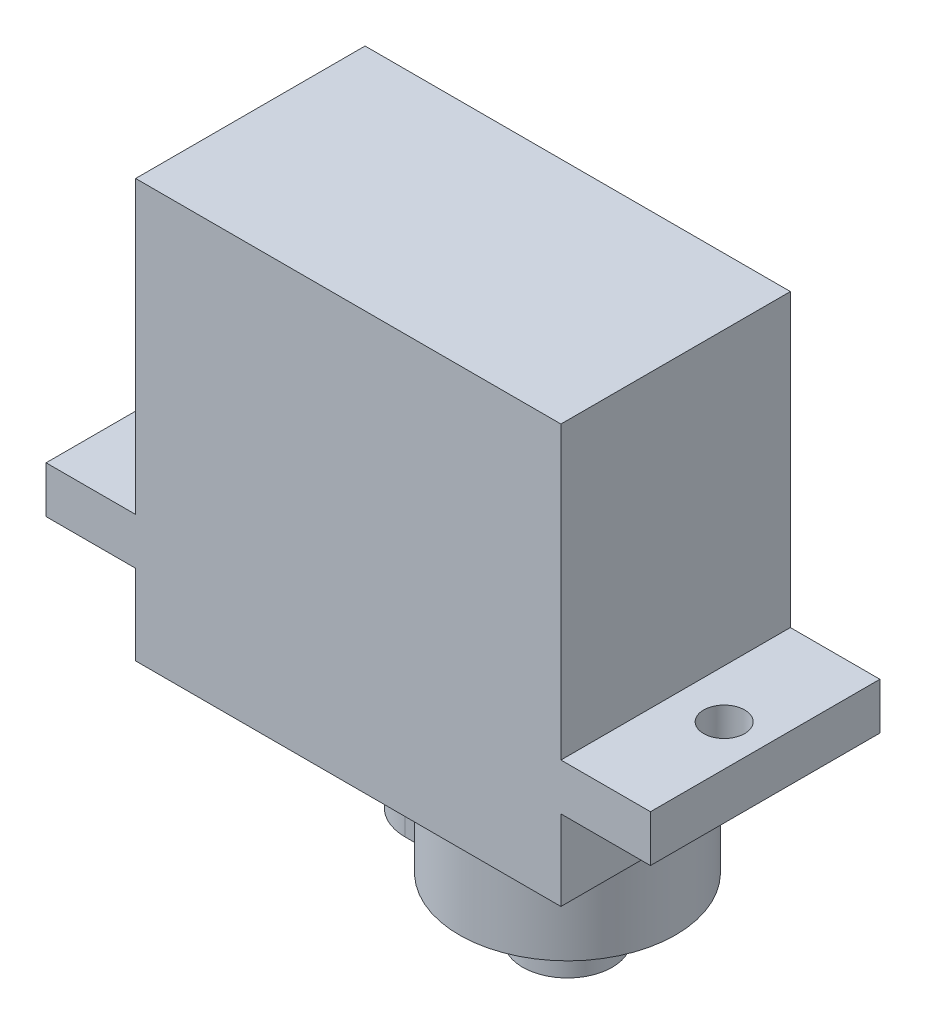
ISO-10303-21;
HEADER;
FILE_DESCRIPTION(('STEP AP214'),'2;1');
FILE_NAME('part.step','',(''),(''),'','','');
FILE_SCHEMA(('AUTOMOTIVE_DESIGN { 1 0 10303 214 1 1 1 1 }'));
ENDSEC;
DATA;
#1=APPLICATION_CONTEXT('core data for automotive mechanical design processes');
#2=APPLICATION_PROTOCOL_DEFINITION('international standard','automotive_design',2000,#1);
#3=PRODUCT_CONTEXT('',#1,'mechanical');
#4=PRODUCT('Part','Part','',(#3));
#5=PRODUCT_RELATED_PRODUCT_CATEGORY('part','',(#4));
#6=PRODUCT_DEFINITION_FORMATION('','',#4);
#7=PRODUCT_DEFINITION_CONTEXT('part definition',#1,'design');
#8=PRODUCT_DEFINITION('design','',#6,#7);
#9=PRODUCT_DEFINITION_SHAPE('','',#8);
#10=(LENGTH_UNIT() NAMED_UNIT(*) SI_UNIT(.MILLI.,.METRE.));
#11=(NAMED_UNIT(*) PLANE_ANGLE_UNIT() SI_UNIT($,.RADIAN.));
#12=(NAMED_UNIT(*) SI_UNIT($,.STERADIAN.) SOLID_ANGLE_UNIT());
#13=UNCERTAINTY_MEASURE_WITH_UNIT(LENGTH_MEASURE(1.E-05),#10,'distance_accuracy_value','');
#14=(GEOMETRIC_REPRESENTATION_CONTEXT(3) GLOBAL_UNCERTAINTY_ASSIGNED_CONTEXT((#13)) GLOBAL_UNIT_ASSIGNED_CONTEXT((#10,
#11,#12)) REPRESENTATION_CONTEXT('',''));
#15=CARTESIAN_POINT('',(0.,0.,0.));
#16=DIRECTION('',(0.,0.,1.));
#17=DIRECTION('',(1.,0.,0.));
#18=AXIS2_PLACEMENT_3D('',#15,#16,#17);
#19=CARTESIAN_POINT('',(5.60000000000001,-11.9,6.15));
#20=DIRECTION('',(0.,1.,0.));
#21=DIRECTION('',(-1.,0.,0.));
#22=AXIS2_PLACEMENT_3D('',#19,#20,#21);
#23=CYLINDRICAL_SURFACE('',#22,2.4);
#24=CARTESIAN_POINT('',(5.60000000000001,-11.9,6.15));
#25=DIRECTION('',(0.,-1.,0.));
#26=DIRECTION('',(1.,0.,0.));
#27=AXIS2_PLACEMENT_3D('',#24,#25,#26);
#28=CIRCLE('',#27,2.4);
#29=CARTESIAN_POINT('',(8.00000000000001,-11.9,6.15));
#30=VERTEX_POINT('',#29);
#31=EDGE_CURVE('E12',#30,#30,#28,.T.);
#32=ORIENTED_EDGE('',*,*,#31,.F.);
#33=EDGE_LOOP('',(#32));
#34=FACE_BOUND('',#33,.T.);
#35=CARTESIAN_POINT('',(5.60000000000001,-8.7,6.15));
#36=DIRECTION('',(0.,-1.,0.));
#37=DIRECTION('',(1.,0.,0.));
#38=AXIS2_PLACEMENT_3D('',#35,#36,#37);
#39=CIRCLE('',#38,2.4);
#40=CARTESIAN_POINT('',(8.00000000000001,-8.7,6.15));
#41=VERTEX_POINT('',#40);
#42=EDGE_CURVE('E46',#41,#41,#39,.T.);
#43=ORIENTED_EDGE('',*,*,#42,.T.);
#44=EDGE_LOOP('',(#43));
#45=FACE_BOUND('',#44,.T.);
#46=ADVANCED_FACE('F43',(#34,#45),#23,.T.);
#47=CARTESIAN_POINT('',(5.60000000000001,-11.9,6.15));
#48=DIRECTION('',(0.,-1.,0.));
#49=DIRECTION('',(1.,0.,0.));
#50=AXIS2_PLACEMENT_3D('',#47,#48,#49);
#51=PLANE('',#50);
#52=ORIENTED_EDGE('',*,*,#31,.T.);
#53=EDGE_LOOP('',(#52));
#54=FACE_BOUND('',#53,.T.);
#55=ADVANCED_FACE('F58',(#54),#51,.T.);
#56=CARTESIAN_POINT('',(5.60000000000001,-8.7,6.15));
#57=DIRECTION('',(0.,-1.,0.));
#58=DIRECTION('',(1.,0.,0.));
#59=AXIS2_PLACEMENT_3D('',#56,#57,#58);
#60=PLANE('',#59);
#61=ORIENTED_EDGE('',*,*,#42,.F.);
#62=EDGE_LOOP('',(#61));
#63=FACE_BOUND('',#62,.T.);
#64=ADVANCED_FACE('F56',(#63),#60,.F.);
#65=CLOSED_SHELL('',(#46,#55,#64));
#66=MANIFOLD_SOLID_BREP('B2',#65);
#67=CARTESIAN_POINT('',(-11.4,-4.3,12.3));
#68=DIRECTION('',(0.,1.,0.));
#69=DIRECTION('',(-1.,0.,0.));
#70=AXIS2_PLACEMENT_3D('',#67,#68,#69);
#71=PLANE('',#70);
#72=DIRECTION('',(-1.,0.,0.));
#73=VECTOR('',#72,1.);
#74=CARTESIAN_POINT('',(-0.399999999999992,-4.3,8.85));
#75=LINE('',#74,#73);
#76=CARTESIAN_POINT('',(0.466774892915768,-4.3,8.85));
#77=VERTEX_POINT('',#76);
#78=CARTESIAN_POINT('',(-0.399999999999992,-4.3,8.85));
#79=VERTEX_POINT('',#78);
#80=EDGE_CURVE('E100',#77,#79,#75,.T.);
#81=ORIENTED_EDGE('',*,*,#80,.F.);
#82=CARTESIAN_POINT('',(5.60000000000001,-4.3,6.15));
#83=DIRECTION('',(0.,-1.,0.));
#84=DIRECTION('',(1.,0.,0.));
#85=AXIS2_PLACEMENT_3D('',#82,#83,#84);
#86=CIRCLE('',#85,5.8);
#87=CARTESIAN_POINT('',(11.4,-4.3,6.15));
#88=VERTEX_POINT('',#87);
#89=EDGE_CURVE('E41',#88,#77,#86,.T.);
#90=ORIENTED_EDGE('',*,*,#89,.F.);
#91=DIRECTION('',(0.,0.,-1.));
#92=VECTOR('',#91,1.);
#93=CARTESIAN_POINT('',(11.4,-4.3,12.3));
#94=LINE('',#93,#92);
#95=CARTESIAN_POINT('',(11.4,-4.3,12.3));
#96=VERTEX_POINT('',#95);
#97=EDGE_CURVE('E301',#96,#88,#94,.T.);
#98=ORIENTED_EDGE('',*,*,#97,.F.);
#99=DIRECTION('',(1.,0.,0.));
#100=VECTOR('',#99,1.);
#101=CARTESIAN_POINT('',(-11.4,-4.3,12.3));
#102=LINE('',#101,#100);
#103=CARTESIAN_POINT('',(-11.4,-4.3,12.3));
#104=VERTEX_POINT('',#103);
#105=EDGE_CURVE('E237',#104,#96,#102,.T.);
#106=ORIENTED_EDGE('',*,*,#105,.F.);
#107=DIRECTION('',(0.,0.,-1.));
#108=VECTOR('',#107,1.);
#109=CARTESIAN_POINT('',(-11.4,-4.3,12.3));
#110=LINE('',#109,#108);
#111=CARTESIAN_POINT('',(-11.4,-4.3,0.));
#112=VERTEX_POINT('',#111);
#113=EDGE_CURVE('E304',#104,#112,#110,.T.);
#114=ORIENTED_EDGE('',*,*,#113,.T.);
#115=DIRECTION('',(1.,0.,0.));
#116=VECTOR('',#115,1.);
#117=CARTESIAN_POINT('',(-11.4,-4.3,0.));
#118=LINE('',#117,#116);
#119=CARTESIAN_POINT('',(11.4,-4.3,0.));
#120=VERTEX_POINT('',#119);
#121=EDGE_CURVE('E259',#112,#120,#118,.T.);
#122=ORIENTED_EDGE('',*,*,#121,.T.);
#123=EDGE_CURVE('E300',#88,#120,#94,.T.);
#124=ORIENTED_EDGE('',*,*,#123,.F.);
#125=CARTESIAN_POINT('',(0.466774892915769,-4.3,3.45));
#126=VERTEX_POINT('',#125);
#127=EDGE_CURVE('E93',#126,#88,#86,.T.);
#128=ORIENTED_EDGE('',*,*,#127,.F.);
#129=DIRECTION('',(1.,0.,0.));
#130=VECTOR('',#129,1.);
#131=CARTESIAN_POINT('',(-0.399999999999992,-4.3,3.45));
#132=LINE('',#131,#130);
#133=CARTESIAN_POINT('',(-0.399999999999992,-4.3,3.45));
#134=VERTEX_POINT('',#133);
#135=EDGE_CURVE('E370',#134,#126,#132,.T.);
#136=ORIENTED_EDGE('',*,*,#135,.F.);
#137=CARTESIAN_POINT('',(-0.399999999999992,-4.3,6.15));
#138=DIRECTION('',(0.,-1.,0.));
#139=DIRECTION('',(1.,0.,0.));
#140=AXIS2_PLACEMENT_3D('',#137,#138,#139);
#141=CIRCLE('',#140,2.7);
#142=EDGE_CURVE('E104',#79,#134,#141,.T.);
#143=ORIENTED_EDGE('',*,*,#142,.F.);
#144=EDGE_LOOP('',(#81,#90,#98,#106,#114,#122,#124,#128,#136,#143));
#145=FACE_BOUND('',#144,.T.);
#146=ADVANCED_FACE('F83',(#145),#71,.F.);
#147=CARTESIAN_POINT('',(-16.2,2.5,12.3));
#148=DIRECTION('',(1.,0.,0.));
#149=DIRECTION('',(0.,0.,-1.));
#150=AXIS2_PLACEMENT_3D('',#147,#148,#149);
#151=PLANE('',#150);
#152=DIRECTION('',(0.,-1.,0.));
#153=VECTOR('',#152,1.);
#154=CARTESIAN_POINT('',(-16.2,2.5,0.));
#155=LINE('',#154,#153);
#156=CARTESIAN_POINT('',(-16.2,2.5,0.));
#157=VERTEX_POINT('',#156);
#158=CARTESIAN_POINT('',(-16.2,0.,0.));
#159=VERTEX_POINT('',#158);
#160=EDGE_CURVE('E220',#157,#159,#155,.T.);
#161=ORIENTED_EDGE('',*,*,#160,.T.);
#162=DIRECTION('',(0.,0.,-1.));
#163=VECTOR('',#162,1.);
#164=CARTESIAN_POINT('',(-16.2,0.,12.3));
#165=LINE('',#164,#163);
#166=CARTESIAN_POINT('',(-16.2,0.,12.3));
#167=VERTEX_POINT('',#166);
#168=EDGE_CURVE('E87',#167,#159,#165,.T.);
#169=ORIENTED_EDGE('',*,*,#168,.F.);
#170=DIRECTION('',(0.,-1.,0.));
#171=VECTOR('',#170,1.);
#172=CARTESIAN_POINT('',(-16.2,2.5,12.3));
#173=LINE('',#172,#171);
#174=CARTESIAN_POINT('',(-16.2,2.5,12.3));
#175=VERTEX_POINT('',#174);
#176=EDGE_CURVE('E229',#175,#167,#173,.T.);
#177=ORIENTED_EDGE('',*,*,#176,.F.);
#178=DIRECTION('',(0.,0.,-1.));
#179=VECTOR('',#178,1.);
#180=CARTESIAN_POINT('',(-16.2,2.5,12.3));
#181=LINE('',#180,#179);
#182=EDGE_CURVE('E254',#175,#157,#181,.T.);
#183=ORIENTED_EDGE('',*,*,#182,.T.);
#184=EDGE_LOOP('',(#161,#169,#177,#183));
#185=FACE_BOUND('',#184,.T.);
#186=ADVANCED_FACE('F85',(#185),#151,.F.);
#187=CARTESIAN_POINT('',(-16.2,0.,12.3));
#188=DIRECTION('',(0.,1.,0.));
#189=DIRECTION('',(-1.,0.,0.));
#190=AXIS2_PLACEMENT_3D('',#187,#188,#189);
#191=PLANE('',#190);
#192=CARTESIAN_POINT('',(-14.,0.,6.15));
#193=DIRECTION('',(0.,1.,0.));
#194=DIRECTION('',(-1.,0.,0.));
#195=AXIS2_PLACEMENT_3D('',#192,#193,#194);
#196=CIRCLE('',#195,1.1);
#197=CARTESIAN_POINT('',(-15.1,0.,6.15));
#198=VERTEX_POINT('',#197);
#199=EDGE_CURVE('E380',#198,#198,#196,.T.);
#200=ORIENTED_EDGE('',*,*,#199,.T.);
#201=EDGE_LOOP('',(#200));
#202=FACE_BOUND('',#201,.T.);
#203=DIRECTION('',(1.,0.,0.));
#204=VECTOR('',#203,1.);
#205=CARTESIAN_POINT('',(-16.2,0.,0.));
#206=LINE('',#205,#204);
#207=CARTESIAN_POINT('',(-11.4,0.,0.));
#208=VERTEX_POINT('',#207);
#209=EDGE_CURVE('E223',#159,#208,#206,.T.);
#210=ORIENTED_EDGE('',*,*,#209,.T.);
#211=DIRECTION('',(0.,0.,-1.));
#212=VECTOR('',#211,1.);
#213=CARTESIAN_POINT('',(-11.4,0.,12.3));
#214=LINE('',#213,#212);
#215=CARTESIAN_POINT('',(-11.4,0.,12.3));
#216=VERTEX_POINT('',#215);
#217=EDGE_CURVE('E306',#216,#208,#214,.T.);
#218=ORIENTED_EDGE('',*,*,#217,.F.);
#219=DIRECTION('',(1.,0.,0.));
#220=VECTOR('',#219,1.);
#221=CARTESIAN_POINT('',(-16.2,0.,12.3));
#222=LINE('',#221,#220);
#223=EDGE_CURVE('E232',#167,#216,#222,.T.);
#224=ORIENTED_EDGE('',*,*,#223,.F.);
#225=ORIENTED_EDGE('',*,*,#168,.T.);
#226=EDGE_LOOP('',(#210,#218,#224,#225));
#227=FACE_BOUND('',#226,.T.);
#228=ADVANCED_FACE('F315',(#202,#227),#191,.F.);
#229=CARTESIAN_POINT('',(-11.4,0.,12.3));
#230=DIRECTION('',(1.,0.,0.));
#231=DIRECTION('',(0.,0.,-1.));
#232=AXIS2_PLACEMENT_3D('',#229,#230,#231);
#233=PLANE('',#232);
#234=DIRECTION('',(0.,-1.,0.));
#235=VECTOR('',#234,1.);
#236=CARTESIAN_POINT('',(-11.4,0.,0.));
#237=LINE('',#236,#235);
#238=EDGE_CURVE('E257',#208,#112,#237,.T.);
#239=ORIENTED_EDGE('',*,*,#238,.T.);
#240=ORIENTED_EDGE('',*,*,#113,.F.);
#241=DIRECTION('',(0.,-1.,0.));
#242=VECTOR('',#241,1.);
#243=CARTESIAN_POINT('',(-11.4,0.,12.3));
#244=LINE('',#243,#242);
#245=EDGE_CURVE('E235',#216,#104,#244,.T.);
#246=ORIENTED_EDGE('',*,*,#245,.F.);
#247=ORIENTED_EDGE('',*,*,#217,.T.);
#248=EDGE_LOOP('',(#239,#240,#246,#247));
#249=FACE_BOUND('',#248,.T.);
#250=ADVANCED_FACE('F327',(#249),#233,.F.);
#251=CARTESIAN_POINT('',(11.4,-4.3,12.3));
#252=DIRECTION('',(-1.,0.,0.));
#253=DIRECTION('',(0.,-1.,0.));
#254=AXIS2_PLACEMENT_3D('',#251,#252,#253);
#255=PLANE('',#254);
#256=DIRECTION('',(0.,1.,0.));
#257=VECTOR('',#256,1.);
#258=CARTESIAN_POINT('',(11.4,-4.3,0.));
#259=LINE('',#258,#257);
#260=CARTESIAN_POINT('',(11.4,0.,0.));
#261=VERTEX_POINT('',#260);
#262=EDGE_CURVE('E262',#120,#261,#259,.T.);
#263=ORIENTED_EDGE('',*,*,#262,.T.);
#264=DIRECTION('',(0.,0.,-1.));
#265=VECTOR('',#264,1.);
#266=CARTESIAN_POINT('',(11.4,0.,12.3));
#267=LINE('',#266,#265);
#268=CARTESIAN_POINT('',(11.4,0.,12.3));
#269=VERTEX_POINT('',#268);
#270=EDGE_CURVE('E297',#269,#261,#267,.T.);
#271=ORIENTED_EDGE('',*,*,#270,.F.);
#272=DIRECTION('',(0.,1.,0.));
#273=VECTOR('',#272,1.);
#274=CARTESIAN_POINT('',(11.4,-4.3,12.3));
#275=LINE('',#274,#273);
#276=EDGE_CURVE('E239',#96,#269,#275,.T.);
#277=ORIENTED_EDGE('',*,*,#276,.F.);
#278=ORIENTED_EDGE('',*,*,#97,.T.);
#279=ORIENTED_EDGE('',*,*,#123,.T.);
#280=EDGE_LOOP('',(#263,#271,#277,#278,#279));
#281=FACE_BOUND('',#280,.T.);
#282=ADVANCED_FACE('F368',(#281),#255,.F.);
#283=CARTESIAN_POINT('',(11.4,0.,12.3));
#284=DIRECTION('',(0.,1.,0.));
#285=DIRECTION('',(-1.,0.,0.));
#286=AXIS2_PLACEMENT_3D('',#283,#284,#285);
#287=PLANE('',#286);
#288=CARTESIAN_POINT('',(14.,0.,6.15));
#289=DIRECTION('',(0.,1.,0.));
#290=DIRECTION('',(-1.,0.,0.));
#291=AXIS2_PLACEMENT_3D('',#288,#289,#290);
#292=CIRCLE('',#291,1.1);
#293=CARTESIAN_POINT('',(12.9,0.,6.15));
#294=VERTEX_POINT('',#293);
#295=EDGE_CURVE('E413',#294,#294,#292,.T.);
#296=ORIENTED_EDGE('',*,*,#295,.T.);
#297=EDGE_LOOP('',(#296));
#298=FACE_BOUND('',#297,.T.);
#299=DIRECTION('',(1.,0.,0.));
#300=VECTOR('',#299,1.);
#301=CARTESIAN_POINT('',(11.4,0.,0.));
#302=LINE('',#301,#300);
#303=CARTESIAN_POINT('',(16.2,0.,0.));
#304=VERTEX_POINT('',#303);
#305=EDGE_CURVE('E264',#261,#304,#302,.T.);
#306=ORIENTED_EDGE('',*,*,#305,.T.);
#307=DIRECTION('',(0.,0.,-1.));
#308=VECTOR('',#307,1.);
#309=CARTESIAN_POINT('',(16.2,0.,12.3));
#310=LINE('',#309,#308);
#311=CARTESIAN_POINT('',(16.2,0.,12.3));
#312=VERTEX_POINT('',#311);
#313=EDGE_CURVE('E294',#312,#304,#310,.T.);
#314=ORIENTED_EDGE('',*,*,#313,.F.);
#315=DIRECTION('',(1.,0.,0.));
#316=VECTOR('',#315,1.);
#317=CARTESIAN_POINT('',(11.4,0.,12.3));
#318=LINE('',#317,#316);
#319=EDGE_CURVE('E241',#269,#312,#318,.T.);
#320=ORIENTED_EDGE('',*,*,#319,.F.);
#321=ORIENTED_EDGE('',*,*,#270,.T.);
#322=EDGE_LOOP('',(#306,#314,#320,#321));
#323=FACE_BOUND('',#322,.T.);
#324=ADVANCED_FACE('F366',(#298,#323),#287,.F.);
#325=CARTESIAN_POINT('',(16.2,0.,12.3));
#326=DIRECTION('',(-1.,0.,0.));
#327=DIRECTION('',(0.,-1.,0.));
#328=AXIS2_PLACEMENT_3D('',#325,#326,#327);
#329=PLANE('',#328);
#330=DIRECTION('',(0.,1.,0.));
#331=VECTOR('',#330,1.);
#332=CARTESIAN_POINT('',(16.2,0.,0.));
#333=LINE('',#332,#331);
#334=CARTESIAN_POINT('',(16.2,2.5,0.));
#335=VERTEX_POINT('',#334);
#336=EDGE_CURVE('E266',#304,#335,#333,.T.);
#337=ORIENTED_EDGE('',*,*,#336,.T.);
#338=DIRECTION('',(0.,0.,-1.));
#339=VECTOR('',#338,1.);
#340=CARTESIAN_POINT('',(16.2,2.5,12.3));
#341=LINE('',#340,#339);
#342=CARTESIAN_POINT('',(16.2,2.5,12.3));
#343=VERTEX_POINT('',#342);
#344=EDGE_CURVE('E291',#343,#335,#341,.T.);
#345=ORIENTED_EDGE('',*,*,#344,.F.);
#346=DIRECTION('',(0.,1.,0.));
#347=VECTOR('',#346,1.);
#348=CARTESIAN_POINT('',(16.2,0.,12.3));
#349=LINE('',#348,#347);
#350=EDGE_CURVE('E243',#312,#343,#349,.T.);
#351=ORIENTED_EDGE('',*,*,#350,.F.);
#352=ORIENTED_EDGE('',*,*,#313,.T.);
#353=EDGE_LOOP('',(#337,#345,#351,#352));
#354=FACE_BOUND('',#353,.T.);
#355=ADVANCED_FACE('F361',(#354),#329,.F.);
#356=CARTESIAN_POINT('',(16.2,2.5,12.3));
#357=DIRECTION('',(0.,-1.,0.));
#358=DIRECTION('',(1.,0.,0.));
#359=AXIS2_PLACEMENT_3D('',#356,#357,#358);
#360=PLANE('',#359);
#361=CARTESIAN_POINT('',(14.,2.5,6.15));
#362=DIRECTION('',(0.,1.,0.));
#363=DIRECTION('',(0.,0.,1.));
#364=AXIS2_PLACEMENT_3D('',#361,#362,#363);
#365=CIRCLE('',#364,1.1);
#366=CARTESIAN_POINT('',(14.,2.5,7.25));
#367=VERTEX_POINT('',#366);
#368=EDGE_CURVE('E418',#367,#367,#365,.T.);
#369=ORIENTED_EDGE('',*,*,#368,.F.);
#370=EDGE_LOOP('',(#369));
#371=FACE_BOUND('',#370,.T.);
#372=DIRECTION('',(-1.,0.,0.));
#373=VECTOR('',#372,1.);
#374=CARTESIAN_POINT('',(16.2,2.5,0.));
#375=LINE('',#374,#373);
#376=CARTESIAN_POINT('',(11.4,2.5,0.));
#377=VERTEX_POINT('',#376);
#378=EDGE_CURVE('E268',#335,#377,#375,.T.);
#379=ORIENTED_EDGE('',*,*,#378,.T.);
#380=DIRECTION('',(0.,0.,-1.));
#381=VECTOR('',#380,1.);
#382=CARTESIAN_POINT('',(11.4,2.5,12.3));
#383=LINE('',#382,#381);
#384=CARTESIAN_POINT('',(11.4,2.5,12.3));
#385=VERTEX_POINT('',#384);
#386=EDGE_CURVE('E288',#385,#377,#383,.T.);
#387=ORIENTED_EDGE('',*,*,#386,.F.);
#388=DIRECTION('',(-1.,0.,0.));
#389=VECTOR('',#388,1.);
#390=CARTESIAN_POINT('',(16.2,2.5,12.3));
#391=LINE('',#390,#389);
#392=EDGE_CURVE('E245',#343,#385,#391,.T.);
#393=ORIENTED_EDGE('',*,*,#392,.F.);
#394=ORIENTED_EDGE('',*,*,#344,.T.);
#395=EDGE_LOOP('',(#379,#387,#393,#394));
#396=FACE_BOUND('',#395,.T.);
#397=ADVANCED_FACE('F356',(#371,#396),#360,.F.);
#398=CARTESIAN_POINT('',(11.4,2.5,12.3));
#399=DIRECTION('',(-1.,0.,0.));
#400=DIRECTION('',(0.,-1.,0.));
#401=AXIS2_PLACEMENT_3D('',#398,#399,#400);
#402=PLANE('',#401);
#403=DIRECTION('',(0.,1.,0.));
#404=VECTOR('',#403,1.);
#405=CARTESIAN_POINT('',(11.4,2.5,0.));
#406=LINE('',#405,#404);
#407=CARTESIAN_POINT('',(11.4,18.1,0.));
#408=VERTEX_POINT('',#407);
#409=EDGE_CURVE('E270',#377,#408,#406,.T.);
#410=ORIENTED_EDGE('',*,*,#409,.T.);
#411=DIRECTION('',(0.,0.,-1.));
#412=VECTOR('',#411,1.);
#413=CARTESIAN_POINT('',(11.4,18.1,12.3));
#414=LINE('',#413,#412);
#415=CARTESIAN_POINT('',(11.4,18.1,12.3));
#416=VERTEX_POINT('',#415);
#417=EDGE_CURVE('E285',#416,#408,#414,.T.);
#418=ORIENTED_EDGE('',*,*,#417,.F.);
#419=DIRECTION('',(0.,1.,0.));
#420=VECTOR('',#419,1.);
#421=CARTESIAN_POINT('',(11.4,2.5,12.3));
#422=LINE('',#421,#420);
#423=EDGE_CURVE('E247',#385,#416,#422,.T.);
#424=ORIENTED_EDGE('',*,*,#423,.F.);
#425=ORIENTED_EDGE('',*,*,#386,.T.);
#426=EDGE_LOOP('',(#410,#418,#424,#425));
#427=FACE_BOUND('',#426,.T.);
#428=ADVANCED_FACE('F352',(#427),#402,.F.);
#429=CARTESIAN_POINT('',(11.4,18.1,12.3));
#430=DIRECTION('',(0.,-1.,0.));
#431=DIRECTION('',(1.,0.,0.));
#432=AXIS2_PLACEMENT_3D('',#429,#430,#431);
#433=PLANE('',#432);
#434=DIRECTION('',(-1.,0.,0.));
#435=VECTOR('',#434,1.);
#436=CARTESIAN_POINT('',(11.4,18.1,0.));
#437=LINE('',#436,#435);
#438=CARTESIAN_POINT('',(-11.4,18.1,0.));
#439=VERTEX_POINT('',#438);
#440=EDGE_CURVE('E272',#408,#439,#437,.T.);
#441=ORIENTED_EDGE('',*,*,#440,.T.);
#442=DIRECTION('',(0.,0.,-1.));
#443=VECTOR('',#442,1.);
#444=CARTESIAN_POINT('',(-11.4,18.1,12.3));
#445=LINE('',#444,#443);
#446=CARTESIAN_POINT('',(-11.4,18.1,12.3));
#447=VERTEX_POINT('',#446);
#448=EDGE_CURVE('E282',#447,#439,#445,.T.);
#449=ORIENTED_EDGE('',*,*,#448,.F.);
#450=DIRECTION('',(-1.,0.,0.));
#451=VECTOR('',#450,1.);
#452=CARTESIAN_POINT('',(11.4,18.1,12.3));
#453=LINE('',#452,#451);
#454=EDGE_CURVE('E249',#416,#447,#453,.T.);
#455=ORIENTED_EDGE('',*,*,#454,.F.);
#456=ORIENTED_EDGE('',*,*,#417,.T.);
#457=EDGE_LOOP('',(#441,#449,#455,#456));
#458=FACE_BOUND('',#457,.T.);
#459=ADVANCED_FACE('F347',(#458),#433,.F.);
#460=CARTESIAN_POINT('',(-11.4,18.1,12.3));
#461=DIRECTION('',(1.,0.,0.));
#462=DIRECTION('',(0.,0.,-1.));
#463=AXIS2_PLACEMENT_3D('',#460,#461,#462);
#464=PLANE('',#463);
#465=DIRECTION('',(0.,-1.,0.));
#466=VECTOR('',#465,1.);
#467=CARTESIAN_POINT('',(-11.4,18.1,0.));
#468=LINE('',#467,#466);
#469=CARTESIAN_POINT('',(-11.4,2.5,0.));
#470=VERTEX_POINT('',#469);
#471=EDGE_CURVE('E274',#439,#470,#468,.T.);
#472=ORIENTED_EDGE('',*,*,#471,.T.);
#473=DIRECTION('',(0.,0.,-1.));
#474=VECTOR('',#473,1.);
#475=CARTESIAN_POINT('',(-11.4,2.5,12.3));
#476=LINE('',#475,#474);
#477=CARTESIAN_POINT('',(-11.4,2.5,12.3));
#478=VERTEX_POINT('',#477);
#479=EDGE_CURVE('E279',#478,#470,#476,.T.);
#480=ORIENTED_EDGE('',*,*,#479,.F.);
#481=DIRECTION('',(0.,-1.,0.));
#482=VECTOR('',#481,1.);
#483=CARTESIAN_POINT('',(-11.4,18.1,12.3));
#484=LINE('',#483,#482);
#485=EDGE_CURVE('E251',#447,#478,#484,.T.);
#486=ORIENTED_EDGE('',*,*,#485,.F.);
#487=ORIENTED_EDGE('',*,*,#448,.T.);
#488=EDGE_LOOP('',(#472,#480,#486,#487));
#489=FACE_BOUND('',#488,.T.);
#490=ADVANCED_FACE('F341',(#489),#464,.F.);
#491=CARTESIAN_POINT('',(-11.4,2.5,12.3));
#492=DIRECTION('',(0.,-1.,0.));
#493=DIRECTION('',(1.,0.,0.));
#494=AXIS2_PLACEMENT_3D('',#491,#492,#493);
#495=PLANE('',#494);
#496=CARTESIAN_POINT('',(-14.,2.5,6.15));
#497=DIRECTION('',(0.,1.,0.));
#498=DIRECTION('',(0.,0.,1.));
#499=AXIS2_PLACEMENT_3D('',#496,#497,#498);
#500=CIRCLE('',#499,1.1);
#501=CARTESIAN_POINT('',(-14.,2.5,7.25));
#502=VERTEX_POINT('',#501);
#503=EDGE_CURVE('E410',#502,#502,#500,.T.);
#504=ORIENTED_EDGE('',*,*,#503,.F.);
#505=EDGE_LOOP('',(#504));
#506=FACE_BOUND('',#505,.T.);
#507=DIRECTION('',(-1.,0.,0.));
#508=VECTOR('',#507,1.);
#509=CARTESIAN_POINT('',(-11.4,2.5,0.));
#510=LINE('',#509,#508);
#511=EDGE_CURVE('E233',#470,#157,#510,.T.);
#512=ORIENTED_EDGE('',*,*,#511,.T.);
#513=ORIENTED_EDGE('',*,*,#182,.F.);
#514=DIRECTION('',(-1.,0.,0.));
#515=VECTOR('',#514,1.);
#516=CARTESIAN_POINT('',(-11.4,2.5,12.3));
#517=LINE('',#516,#515);
#518=EDGE_CURVE('E253',#478,#175,#517,.T.);
#519=ORIENTED_EDGE('',*,*,#518,.F.);
#520=ORIENTED_EDGE('',*,*,#479,.T.);
#521=EDGE_LOOP('',(#512,#513,#519,#520));
#522=FACE_BOUND('',#521,.T.);
#523=ADVANCED_FACE('F339',(#506,#522),#495,.F.);
#524=CARTESIAN_POINT('',(0.,0.,12.3));
#525=DIRECTION('',(0.,0.,1.));
#526=DIRECTION('',(1.,0.,0.));
#527=AXIS2_PLACEMENT_3D('',#524,#525,#526);
#528=PLANE('',#527);
#529=ORIENTED_EDGE('',*,*,#176,.T.);
#530=ORIENTED_EDGE('',*,*,#223,.T.);
#531=ORIENTED_EDGE('',*,*,#245,.T.);
#532=ORIENTED_EDGE('',*,*,#105,.T.);
#533=ORIENTED_EDGE('',*,*,#276,.T.);
#534=ORIENTED_EDGE('',*,*,#319,.T.);
#535=ORIENTED_EDGE('',*,*,#350,.T.);
#536=ORIENTED_EDGE('',*,*,#392,.T.);
#537=ORIENTED_EDGE('',*,*,#423,.T.);
#538=ORIENTED_EDGE('',*,*,#454,.T.);
#539=ORIENTED_EDGE('',*,*,#485,.T.);
#540=ORIENTED_EDGE('',*,*,#518,.T.);
#541=EDGE_LOOP('',(#529,#530,#531,#532,#533,#534,#535,#536,#537,#538,#539,#540));
#542=FACE_BOUND('',#541,.T.);
#543=ADVANCED_FACE('F333',(#542),#528,.T.);
#544=CARTESIAN_POINT('',(0.,0.,0.));
#545=DIRECTION('',(0.,0.,1.));
#546=DIRECTION('',(1.,0.,0.));
#547=AXIS2_PLACEMENT_3D('',#544,#545,#546);
#548=PLANE('',#547);
#549=ORIENTED_EDGE('',*,*,#160,.F.);
#550=ORIENTED_EDGE('',*,*,#511,.F.);
#551=ORIENTED_EDGE('',*,*,#471,.F.);
#552=ORIENTED_EDGE('',*,*,#440,.F.);
#553=ORIENTED_EDGE('',*,*,#409,.F.);
#554=ORIENTED_EDGE('',*,*,#378,.F.);
#555=ORIENTED_EDGE('',*,*,#336,.F.);
#556=ORIENTED_EDGE('',*,*,#305,.F.);
#557=ORIENTED_EDGE('',*,*,#262,.F.);
#558=ORIENTED_EDGE('',*,*,#121,.F.);
#559=ORIENTED_EDGE('',*,*,#238,.F.);
#560=ORIENTED_EDGE('',*,*,#209,.F.);
#561=EDGE_LOOP('',(#549,#550,#551,#552,#553,#554,#555,#556,#557,#558,#559,#560));
#562=FACE_BOUND('',#561,.T.);
#563=ADVANCED_FACE('F322',(#562),#548,.F.);
#564=CARTESIAN_POINT('',(-0.399999999999991,-8.7,6.15));
#565=DIRECTION('',(0.,1.,0.));
#566=DIRECTION('',(-1.,0.,0.));
#567=AXIS2_PLACEMENT_3D('',#564,#565,#566);
#568=CYLINDRICAL_SURFACE('',#567,2.7);
#569=ORIENTED_EDGE('',*,*,#142,.T.);
#570=DIRECTION('',(0.,1.,0.));
#571=VECTOR('',#570,1.);
#572=CARTESIAN_POINT('',(-0.399999999999991,-8.7,3.45));
#573=LINE('',#572,#571);
#574=CARTESIAN_POINT('',(-0.399999999999991,-8.7,3.45));
#575=VERTEX_POINT('',#574);
#576=EDGE_CURVE('E203',#575,#134,#573,.T.);
#577=ORIENTED_EDGE('',*,*,#576,.F.);
#578=CARTESIAN_POINT('',(-0.399999999999991,-8.7,6.15));
#579=DIRECTION('',(0.,-1.,0.));
#580=DIRECTION('',(1.,0.,0.));
#581=AXIS2_PLACEMENT_3D('',#578,#579,#580);
#582=CIRCLE('',#581,2.7);
#583=CARTESIAN_POINT('',(-0.399999999999992,-8.7,8.85));
#584=VERTEX_POINT('',#583);
#585=EDGE_CURVE('E209',#584,#575,#582,.T.);
#586=ORIENTED_EDGE('',*,*,#585,.F.);
#587=DIRECTION('',(0.,1.,0.));
#588=VECTOR('',#587,1.);
#589=CARTESIAN_POINT('',(-0.399999999999992,-8.7,8.85));
#590=LINE('',#589,#588);
#591=EDGE_CURVE('E377',#584,#79,#590,.T.);
#592=ORIENTED_EDGE('',*,*,#591,.T.);
#593=EDGE_LOOP('',(#569,#577,#586,#592));
#594=FACE_BOUND('',#593,.T.);
#595=ADVANCED_FACE('F219',(#594),#568,.T.);
#596=CARTESIAN_POINT('',(-0.399999999999991,-8.7,3.45));
#597=DIRECTION('',(0.,0.,1.));
#598=DIRECTION('',(1.,0.,0.));
#599=AXIS2_PLACEMENT_3D('',#596,#597,#598);
#600=PLANE('',#599);
#601=ORIENTED_EDGE('',*,*,#135,.T.);
#602=DIRECTION('',(0.,1.,0.));
#603=VECTOR('',#602,1.);
#604=CARTESIAN_POINT('',(0.466774892915769,-8.7,3.45));
#605=LINE('',#604,#603);
#606=CARTESIAN_POINT('',(0.466774892915769,-8.7,3.45));
#607=VERTEX_POINT('',#606);
#608=EDGE_CURVE('E205',#607,#126,#605,.T.);
#609=ORIENTED_EDGE('',*,*,#608,.F.);
#610=DIRECTION('',(1.,0.,0.));
#611=VECTOR('',#610,1.);
#612=CARTESIAN_POINT('',(-0.399999999999991,-8.7,3.45));
#613=LINE('',#612,#611);
#614=EDGE_CURVE('E198',#575,#607,#613,.T.);
#615=ORIENTED_EDGE('',*,*,#614,.F.);
#616=ORIENTED_EDGE('',*,*,#576,.T.);
#617=EDGE_LOOP('',(#601,#609,#615,#616));
#618=FACE_BOUND('',#617,.T.);
#619=ADVANCED_FACE('F201',(#618),#600,.F.);
#620=CARTESIAN_POINT('',(5.60000000000001,-8.7,6.15));
#621=DIRECTION('',(0.,1.,0.));
#622=DIRECTION('',(-1.,0.,0.));
#623=AXIS2_PLACEMENT_3D('',#620,#621,#622);
#624=CYLINDRICAL_SURFACE('',#623,5.8);
#625=ORIENTED_EDGE('',*,*,#127,.T.);
#626=ORIENTED_EDGE('',*,*,#89,.T.);
#627=DIRECTION('',(0.,1.,0.));
#628=VECTOR('',#627,1.);
#629=CARTESIAN_POINT('',(0.466774892915769,-8.7,8.85));
#630=LINE('',#629,#628);
#631=CARTESIAN_POINT('',(0.466774892915769,-8.7,8.85));
#632=VERTEX_POINT('',#631);
#633=EDGE_CURVE('E225',#632,#77,#630,.T.);
#634=ORIENTED_EDGE('',*,*,#633,.F.);
#635=CARTESIAN_POINT('',(5.60000000000001,-8.7,6.15));
#636=DIRECTION('',(0.,-1.,0.));
#637=DIRECTION('',(1.,0.,0.));
#638=AXIS2_PLACEMENT_3D('',#635,#636,#637);
#639=CIRCLE('',#638,5.8);
#640=EDGE_CURVE('E208',#607,#632,#639,.T.);
#641=ORIENTED_EDGE('',*,*,#640,.F.);
#642=ORIENTED_EDGE('',*,*,#608,.T.);
#643=EDGE_LOOP('',(#625,#626,#634,#641,#642));
#644=FACE_BOUND('',#643,.T.);
#645=ADVANCED_FACE('F373',(#644),#624,.T.);
#646=CARTESIAN_POINT('',(-0.399999999999992,-8.7,8.85));
#647=DIRECTION('',(0.,0.,-1.));
#648=DIRECTION('',(-1.,0.,0.));
#649=AXIS2_PLACEMENT_3D('',#646,#647,#648);
#650=PLANE('',#649);
#651=ORIENTED_EDGE('',*,*,#80,.T.);
#652=ORIENTED_EDGE('',*,*,#591,.F.);
#653=DIRECTION('',(-1.,0.,0.));
#654=VECTOR('',#653,1.);
#655=CARTESIAN_POINT('',(-0.399999999999992,-8.7,8.85));
#656=LINE('',#655,#654);
#657=EDGE_CURVE('E214',#632,#584,#656,.T.);
#658=ORIENTED_EDGE('',*,*,#657,.F.);
#659=ORIENTED_EDGE('',*,*,#633,.T.);
#660=EDGE_LOOP('',(#651,#652,#658,#659));
#661=FACE_BOUND('',#660,.T.);
#662=ADVANCED_FACE('F384',(#661),#650,.F.);
#663=CARTESIAN_POINT('',(-0.399999999999991,-8.7,6.15));
#664=DIRECTION('',(0.,-1.,0.));
#665=DIRECTION('',(1.,0.,0.));
#666=AXIS2_PLACEMENT_3D('',#663,#664,#665);
#667=PLANE('',#666);
#668=ORIENTED_EDGE('',*,*,#585,.T.);
#669=ORIENTED_EDGE('',*,*,#614,.T.);
#670=ORIENTED_EDGE('',*,*,#640,.T.);
#671=ORIENTED_EDGE('',*,*,#657,.T.);
#672=EDGE_LOOP('',(#668,#669,#670,#671));
#673=FACE_BOUND('',#672,.T.);
#674=ADVANCED_FACE('F212',(#673),#667,.T.);
#675=CARTESIAN_POINT('',(-14.,-5.5,6.15));
#676=DIRECTION('',(0.,1.,0.));
#677=DIRECTION('',(0.,0.,1.));
#678=AXIS2_PLACEMENT_3D('',#675,#676,#677);
#679=CYLINDRICAL_SURFACE('',#678,1.1);
#680=ORIENTED_EDGE('',*,*,#503,.T.);
#681=EDGE_LOOP('',(#680));
#682=FACE_BOUND('',#681,.T.);
#683=ORIENTED_EDGE('',*,*,#199,.F.);
#684=EDGE_LOOP('',(#683));
#685=FACE_BOUND('',#684,.T.);
#686=ADVANCED_FACE('F391',(#682,#685),#679,.F.);
#687=CARTESIAN_POINT('',(14.,-5.5,6.15));
#688=DIRECTION('',(0.,1.,0.));
#689=DIRECTION('',(0.,0.,1.));
#690=AXIS2_PLACEMENT_3D('',#687,#688,#689);
#691=CYLINDRICAL_SURFACE('',#690,1.1);
#692=ORIENTED_EDGE('',*,*,#368,.T.);
#693=EDGE_LOOP('',(#692));
#694=FACE_BOUND('',#693,.T.);
#695=ORIENTED_EDGE('',*,*,#295,.F.);
#696=EDGE_LOOP('',(#695));
#697=FACE_BOUND('',#696,.T.);
#698=ADVANCED_FACE('F422',(#694,#697),#691,.F.);
#699=CLOSED_SHELL('',(#146,#186,#228,#250,#282,#324,#355,#397,#428,#459,#490,#523,#543,#563,
#595,#619,#645,#662,#674,#686,#698));
#700=MANIFOLD_SOLID_BREP('B7',#699);
#701=ADVANCED_BREP_SHAPE_REPRESENTATION('',(#18,#66,#700),#14);
#702=SHAPE_DEFINITION_REPRESENTATION(#9,#701);
ENDSEC;
END-ISO-10303-21;
